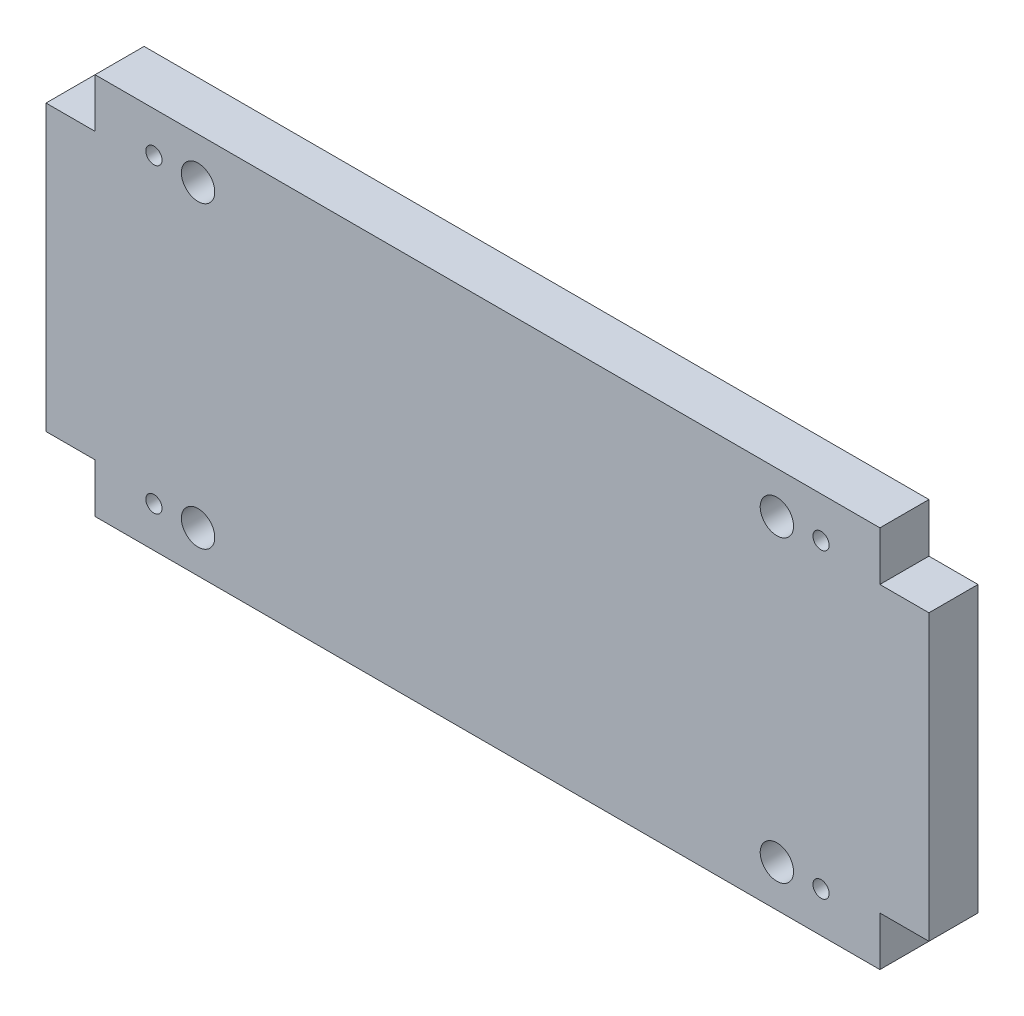
ISO-10303-21;
HEADER;
FILE_DESCRIPTION(('STEP AP214'),'2;1');
FILE_NAME('part.step','',(''),(''),'','','');
FILE_SCHEMA(('AUTOMOTIVE_DESIGN { 1 0 10303 214 1 1 1 1 }'));
ENDSEC;
DATA;
#1=APPLICATION_CONTEXT('core data for automotive mechanical design processes');
#2=APPLICATION_PROTOCOL_DEFINITION('international standard','automotive_design',2000,#1);
#3=PRODUCT_CONTEXT('',#1,'mechanical');
#4=PRODUCT('Part','Part','',(#3));
#5=PRODUCT_RELATED_PRODUCT_CATEGORY('part','',(#4));
#6=PRODUCT_DEFINITION_FORMATION('','',#4);
#7=PRODUCT_DEFINITION_CONTEXT('part definition',#1,'design');
#8=PRODUCT_DEFINITION('design','',#6,#7);
#9=PRODUCT_DEFINITION_SHAPE('','',#8);
#10=(LENGTH_UNIT() NAMED_UNIT(*) SI_UNIT(.MILLI.,.METRE.));
#11=(NAMED_UNIT(*) PLANE_ANGLE_UNIT() SI_UNIT($,.RADIAN.));
#12=(NAMED_UNIT(*) SI_UNIT($,.STERADIAN.) SOLID_ANGLE_UNIT());
#13=UNCERTAINTY_MEASURE_WITH_UNIT(LENGTH_MEASURE(1.E-05),#10,'distance_accuracy_value','');
#14=(GEOMETRIC_REPRESENTATION_CONTEXT(3) GLOBAL_UNCERTAINTY_ASSIGNED_CONTEXT((#13)) GLOBAL_UNIT_ASSIGNED_CONTEXT((#10,
#11,#12)) REPRESENTATION_CONTEXT('',''));
#15=CARTESIAN_POINT('',(0.,0.,0.));
#16=DIRECTION('',(0.,0.,1.));
#17=DIRECTION('',(1.,0.,0.));
#18=AXIS2_PLACEMENT_3D('',#15,#16,#17);
#19=CARTESIAN_POINT('',(80.,-29.,10.));
#20=DIRECTION('',(-1.,0.,0.));
#21=DIRECTION('',(0.,0.,1.));
#22=AXIS2_PLACEMENT_3D('',#19,#20,#21);
#23=PLANE('',#22);
#24=DIRECTION('',(0.,1.,0.));
#25=VECTOR('',#24,1.);
#26=CARTESIAN_POINT('',(80.,-29.,0.));
#27=LINE('',#26,#25);
#28=CARTESIAN_POINT('',(80.,-39.,0.));
#29=VERTEX_POINT('',#28);
#30=CARTESIAN_POINT('',(80.,-29.,0.));
#31=VERTEX_POINT('',#30);
#32=EDGE_CURVE('E168',#29,#31,#27,.T.);
#33=ORIENTED_EDGE('',*,*,#32,.T.);
#34=DIRECTION('',(0.,0.,-1.));
#35=VECTOR('',#34,1.);
#36=CARTESIAN_POINT('',(80.,-29.,10.));
#37=LINE('',#36,#35);
#38=CARTESIAN_POINT('',(80.,-29.,10.));
#39=VERTEX_POINT('',#38);
#40=EDGE_CURVE('E11',#39,#31,#37,.T.);
#41=ORIENTED_EDGE('',*,*,#40,.F.);
#42=DIRECTION('',(0.,1.,0.));
#43=VECTOR('',#42,1.);
#44=CARTESIAN_POINT('',(80.,-29.,10.));
#45=LINE('',#44,#43);
#46=CARTESIAN_POINT('',(80.,-39.,10.));
#47=VERTEX_POINT('',#46);
#48=EDGE_CURVE('E203',#47,#39,#45,.T.);
#49=ORIENTED_EDGE('',*,*,#48,.F.);
#50=DIRECTION('',(0.,0.,-1.));
#51=VECTOR('',#50,1.);
#52=CARTESIAN_POINT('',(80.,-39.,10.));
#53=LINE('',#52,#51);
#54=EDGE_CURVE('E164',#47,#29,#53,.T.);
#55=ORIENTED_EDGE('',*,*,#54,.T.);
#56=EDGE_LOOP('',(#33,#41,#49,#55));
#57=FACE_BOUND('',#56,.T.);
#58=ADVANCED_FACE('F43',(#57),#23,.F.);
#59=CARTESIAN_POINT('',(90.,-29.,10.));
#60=DIRECTION('',(0.,1.,0.));
#61=DIRECTION('',(-1.,0.,0.));
#62=AXIS2_PLACEMENT_3D('',#59,#60,#61);
#63=PLANE('',#62);
#64=DIRECTION('',(1.,0.,0.));
#65=VECTOR('',#64,1.);
#66=CARTESIAN_POINT('',(90.,-29.,0.));
#67=LINE('',#66,#65);
#68=CARTESIAN_POINT('',(90.,-29.,0.));
#69=VERTEX_POINT('',#68);
#70=EDGE_CURVE('E172',#31,#69,#67,.T.);
#71=ORIENTED_EDGE('',*,*,#70,.T.);
#72=DIRECTION('',(0.,0.,-1.));
#73=VECTOR('',#72,1.);
#74=CARTESIAN_POINT('',(90.,-29.,10.));
#75=LINE('',#74,#73);
#76=CARTESIAN_POINT('',(90.,-29.,10.));
#77=VERTEX_POINT('',#76);
#78=EDGE_CURVE('E52',#77,#69,#75,.T.);
#79=ORIENTED_EDGE('',*,*,#78,.F.);
#80=DIRECTION('',(1.,0.,0.));
#81=VECTOR('',#80,1.);
#82=CARTESIAN_POINT('',(90.,-29.,10.));
#83=LINE('',#82,#81);
#84=EDGE_CURVE('E115',#39,#77,#83,.T.);
#85=ORIENTED_EDGE('',*,*,#84,.F.);
#86=ORIENTED_EDGE('',*,*,#40,.T.);
#87=EDGE_LOOP('',(#71,#79,#85,#86));
#88=FACE_BOUND('',#87,.T.);
#89=ADVANCED_FACE('F298',(#88),#63,.F.);
#90=CARTESIAN_POINT('',(90.,29.,10.));
#91=DIRECTION('',(-1.,0.,0.));
#92=DIRECTION('',(0.,0.,1.));
#93=AXIS2_PLACEMENT_3D('',#90,#91,#92);
#94=PLANE('',#93);
#95=DIRECTION('',(0.,1.,0.));
#96=VECTOR('',#95,1.);
#97=CARTESIAN_POINT('',(90.,29.,0.));
#98=LINE('',#97,#96);
#99=CARTESIAN_POINT('',(90.,29.,0.));
#100=VERTEX_POINT('',#99);
#101=EDGE_CURVE('E176',#69,#100,#98,.T.);
#102=ORIENTED_EDGE('',*,*,#101,.T.);
#103=DIRECTION('',(0.,0.,-1.));
#104=VECTOR('',#103,1.);
#105=CARTESIAN_POINT('',(90.,29.,10.));
#106=LINE('',#105,#104);
#107=CARTESIAN_POINT('',(90.,29.,10.));
#108=VERTEX_POINT('',#107);
#109=EDGE_CURVE('E230',#108,#100,#106,.T.);
#110=ORIENTED_EDGE('',*,*,#109,.F.);
#111=DIRECTION('',(0.,1.,0.));
#112=VECTOR('',#111,1.);
#113=CARTESIAN_POINT('',(90.,29.,10.));
#114=LINE('',#113,#112);
#115=EDGE_CURVE('E240',#77,#108,#114,.T.);
#116=ORIENTED_EDGE('',*,*,#115,.F.);
#117=ORIENTED_EDGE('',*,*,#78,.T.);
#118=EDGE_LOOP('',(#102,#110,#116,#117));
#119=FACE_BOUND('',#118,.T.);
#120=ADVANCED_FACE('F238',(#119),#94,.F.);
#121=CARTESIAN_POINT('',(80.,29.,10.));
#122=DIRECTION('',(0.,-1.,0.));
#123=DIRECTION('',(1.,0.,0.));
#124=AXIS2_PLACEMENT_3D('',#121,#122,#123);
#125=PLANE('',#124);
#126=DIRECTION('',(-1.,0.,0.));
#127=VECTOR('',#126,1.);
#128=CARTESIAN_POINT('',(80.,29.,0.));
#129=LINE('',#128,#127);
#130=CARTESIAN_POINT('',(80.,29.,0.));
#131=VERTEX_POINT('',#130);
#132=EDGE_CURVE('E179',#100,#131,#129,.T.);
#133=ORIENTED_EDGE('',*,*,#132,.T.);
#134=DIRECTION('',(0.,0.,-1.));
#135=VECTOR('',#134,1.);
#136=CARTESIAN_POINT('',(80.,29.,10.));
#137=LINE('',#136,#135);
#138=CARTESIAN_POINT('',(80.,29.,10.));
#139=VERTEX_POINT('',#138);
#140=EDGE_CURVE('E226',#139,#131,#137,.T.);
#141=ORIENTED_EDGE('',*,*,#140,.F.);
#142=DIRECTION('',(-1.,0.,0.));
#143=VECTOR('',#142,1.);
#144=CARTESIAN_POINT('',(80.,29.,10.));
#145=LINE('',#144,#143);
#146=EDGE_CURVE('E259',#108,#139,#145,.T.);
#147=ORIENTED_EDGE('',*,*,#146,.F.);
#148=ORIENTED_EDGE('',*,*,#109,.T.);
#149=EDGE_LOOP('',(#133,#141,#147,#148));
#150=FACE_BOUND('',#149,.T.);
#151=ADVANCED_FACE('F249',(#150),#125,.F.);
#152=CARTESIAN_POINT('',(80.,39.,10.));
#153=DIRECTION('',(-1.,0.,0.));
#154=DIRECTION('',(0.,0.,1.));
#155=AXIS2_PLACEMENT_3D('',#152,#153,#154);
#156=PLANE('',#155);
#157=DIRECTION('',(0.,1.,0.));
#158=VECTOR('',#157,1.);
#159=CARTESIAN_POINT('',(80.,39.,0.));
#160=LINE('',#159,#158);
#161=CARTESIAN_POINT('',(80.,39.,0.));
#162=VERTEX_POINT('',#161);
#163=EDGE_CURVE('E182',#131,#162,#160,.T.);
#164=ORIENTED_EDGE('',*,*,#163,.T.);
#165=DIRECTION('',(0.,0.,-1.));
#166=VECTOR('',#165,1.);
#167=CARTESIAN_POINT('',(80.,39.,10.));
#168=LINE('',#167,#166);
#169=CARTESIAN_POINT('',(80.,39.,10.));
#170=VERTEX_POINT('',#169);
#171=EDGE_CURVE('E222',#170,#162,#168,.T.);
#172=ORIENTED_EDGE('',*,*,#171,.F.);
#173=DIRECTION('',(0.,1.,0.));
#174=VECTOR('',#173,1.);
#175=CARTESIAN_POINT('',(80.,39.,10.));
#176=LINE('',#175,#174);
#177=EDGE_CURVE('E255',#139,#170,#176,.T.);
#178=ORIENTED_EDGE('',*,*,#177,.F.);
#179=ORIENTED_EDGE('',*,*,#140,.T.);
#180=EDGE_LOOP('',(#164,#172,#178,#179));
#181=FACE_BOUND('',#180,.T.);
#182=ADVANCED_FACE('F253',(#181),#156,.F.);
#183=CARTESIAN_POINT('',(-80.,39.,10.));
#184=DIRECTION('',(0.,-1.,0.));
#185=DIRECTION('',(0.,0.,-1.));
#186=AXIS2_PLACEMENT_3D('',#183,#184,#185);
#187=PLANE('',#186);
#188=DIRECTION('',(-1.,0.,0.));
#189=VECTOR('',#188,1.);
#190=CARTESIAN_POINT('',(-80.,39.,0.));
#191=LINE('',#190,#189);
#192=CARTESIAN_POINT('',(-80.,39.,0.));
#193=VERTEX_POINT('',#192);
#194=EDGE_CURVE('E185',#162,#193,#191,.T.);
#195=ORIENTED_EDGE('',*,*,#194,.T.);
#196=DIRECTION('',(0.,0.,-1.));
#197=VECTOR('',#196,1.);
#198=CARTESIAN_POINT('',(-80.,39.,10.));
#199=LINE('',#198,#197);
#200=CARTESIAN_POINT('',(-80.,39.,10.));
#201=VERTEX_POINT('',#200);
#202=EDGE_CURVE('E218',#201,#193,#199,.T.);
#203=ORIENTED_EDGE('',*,*,#202,.F.);
#204=DIRECTION('',(-1.,0.,0.));
#205=VECTOR('',#204,1.);
#206=CARTESIAN_POINT('',(-80.,39.,10.));
#207=LINE('',#206,#205);
#208=EDGE_CURVE('E258',#170,#201,#207,.T.);
#209=ORIENTED_EDGE('',*,*,#208,.F.);
#210=ORIENTED_EDGE('',*,*,#171,.T.);
#211=EDGE_LOOP('',(#195,#203,#209,#210));
#212=FACE_BOUND('',#211,.T.);
#213=ADVANCED_FACE('F311',(#212),#187,.F.);
#214=CARTESIAN_POINT('',(-80.,39.,10.));
#215=DIRECTION('',(1.,0.,0.));
#216=DIRECTION('',(0.,0.,-1.));
#217=AXIS2_PLACEMENT_3D('',#214,#215,#216);
#218=PLANE('',#217);
#219=DIRECTION('',(0.,-1.,0.));
#220=VECTOR('',#219,1.);
#221=CARTESIAN_POINT('',(-80.,39.,0.));
#222=LINE('',#221,#220);
#223=CARTESIAN_POINT('',(-80.,29.,0.));
#224=VERTEX_POINT('',#223);
#225=EDGE_CURVE('E188',#193,#224,#222,.T.);
#226=ORIENTED_EDGE('',*,*,#225,.T.);
#227=DIRECTION('',(0.,0.,-1.));
#228=VECTOR('',#227,1.);
#229=CARTESIAN_POINT('',(-80.,29.,10.));
#230=LINE('',#229,#228);
#231=CARTESIAN_POINT('',(-80.,29.,10.));
#232=VERTEX_POINT('',#231);
#233=EDGE_CURVE('E214',#232,#224,#230,.T.);
#234=ORIENTED_EDGE('',*,*,#233,.F.);
#235=DIRECTION('',(0.,-1.,0.));
#236=VECTOR('',#235,1.);
#237=CARTESIAN_POINT('',(-80.,39.,10.));
#238=LINE('',#237,#236);
#239=EDGE_CURVE('E263',#201,#232,#238,.T.);
#240=ORIENTED_EDGE('',*,*,#239,.F.);
#241=ORIENTED_EDGE('',*,*,#202,.T.);
#242=EDGE_LOOP('',(#226,#234,#240,#241));
#243=FACE_BOUND('',#242,.T.);
#244=ADVANCED_FACE('F314',(#243),#218,.F.);
#245=CARTESIAN_POINT('',(-80.,29.,10.));
#246=DIRECTION('',(0.,-1.,0.));
#247=DIRECTION('',(0.,0.,-1.));
#248=AXIS2_PLACEMENT_3D('',#245,#246,#247);
#249=PLANE('',#248);
#250=DIRECTION('',(-1.,0.,0.));
#251=VECTOR('',#250,1.);
#252=CARTESIAN_POINT('',(-80.,29.,0.));
#253=LINE('',#252,#251);
#254=CARTESIAN_POINT('',(-90.,29.,0.));
#255=VERTEX_POINT('',#254);
#256=EDGE_CURVE('E191',#224,#255,#253,.T.);
#257=ORIENTED_EDGE('',*,*,#256,.T.);
#258=DIRECTION('',(0.,0.,-1.));
#259=VECTOR('',#258,1.);
#260=CARTESIAN_POINT('',(-90.,29.,10.));
#261=LINE('',#260,#259);
#262=CARTESIAN_POINT('',(-90.,29.,10.));
#263=VERTEX_POINT('',#262);
#264=EDGE_CURVE('E210',#263,#255,#261,.T.);
#265=ORIENTED_EDGE('',*,*,#264,.F.);
#266=DIRECTION('',(-1.,0.,0.));
#267=VECTOR('',#266,1.);
#268=CARTESIAN_POINT('',(-80.,29.,10.));
#269=LINE('',#268,#267);
#270=EDGE_CURVE('E270',#232,#263,#269,.T.);
#271=ORIENTED_EDGE('',*,*,#270,.F.);
#272=ORIENTED_EDGE('',*,*,#233,.T.);
#273=EDGE_LOOP('',(#257,#265,#271,#272));
#274=FACE_BOUND('',#273,.T.);
#275=ADVANCED_FACE('F278',(#274),#249,.F.);
#276=CARTESIAN_POINT('',(-90.,29.,10.));
#277=DIRECTION('',(1.,0.,0.));
#278=DIRECTION('',(0.,0.,-1.));
#279=AXIS2_PLACEMENT_3D('',#276,#277,#278);
#280=PLANE('',#279);
#281=DIRECTION('',(0.,-1.,0.));
#282=VECTOR('',#281,1.);
#283=CARTESIAN_POINT('',(-90.,29.,0.));
#284=LINE('',#283,#282);
#285=CARTESIAN_POINT('',(-90.,-29.,0.));
#286=VERTEX_POINT('',#285);
#287=EDGE_CURVE('E194',#255,#286,#284,.T.);
#288=ORIENTED_EDGE('',*,*,#287,.T.);
#289=DIRECTION('',(0.,0.,-1.));
#290=VECTOR('',#289,1.);
#291=CARTESIAN_POINT('',(-90.,-29.,10.));
#292=LINE('',#291,#290);
#293=CARTESIAN_POINT('',(-90.,-29.,10.));
#294=VERTEX_POINT('',#293);
#295=EDGE_CURVE('E157',#294,#286,#292,.T.);
#296=ORIENTED_EDGE('',*,*,#295,.F.);
#297=DIRECTION('',(0.,-1.,0.));
#298=VECTOR('',#297,1.);
#299=CARTESIAN_POINT('',(-90.,29.,10.));
#300=LINE('',#299,#298);
#301=EDGE_CURVE('E146',#263,#294,#300,.T.);
#302=ORIENTED_EDGE('',*,*,#301,.F.);
#303=ORIENTED_EDGE('',*,*,#264,.T.);
#304=EDGE_LOOP('',(#288,#296,#302,#303));
#305=FACE_BOUND('',#304,.T.);
#306=ADVANCED_FACE('F282',(#305),#280,.F.);
#307=CARTESIAN_POINT('',(-90.,-29.,10.));
#308=DIRECTION('',(0.,1.,0.));
#309=DIRECTION('',(-1.,0.,0.));
#310=AXIS2_PLACEMENT_3D('',#307,#308,#309);
#311=PLANE('',#310);
#312=DIRECTION('',(1.,0.,0.));
#313=VECTOR('',#312,1.);
#314=CARTESIAN_POINT('',(-90.,-29.,0.));
#315=LINE('',#314,#313);
#316=CARTESIAN_POINT('',(-80.,-29.,0.));
#317=VERTEX_POINT('',#316);
#318=EDGE_CURVE('E155',#286,#317,#315,.T.);
#319=ORIENTED_EDGE('',*,*,#318,.T.);
#320=DIRECTION('',(0.,0.,-1.));
#321=VECTOR('',#320,1.);
#322=CARTESIAN_POINT('',(-80.,-29.,10.));
#323=LINE('',#322,#321);
#324=CARTESIAN_POINT('',(-80.,-29.,10.));
#325=VERTEX_POINT('',#324);
#326=EDGE_CURVE('E152',#325,#317,#323,.T.);
#327=ORIENTED_EDGE('',*,*,#326,.F.);
#328=DIRECTION('',(1.,0.,0.));
#329=VECTOR('',#328,1.);
#330=CARTESIAN_POINT('',(-90.,-29.,10.));
#331=LINE('',#330,#329);
#332=EDGE_CURVE('E140',#294,#325,#331,.T.);
#333=ORIENTED_EDGE('',*,*,#332,.F.);
#334=ORIENTED_EDGE('',*,*,#295,.T.);
#335=EDGE_LOOP('',(#319,#327,#333,#334));
#336=FACE_BOUND('',#335,.T.);
#337=ADVANCED_FACE('F153',(#336),#311,.F.);
#338=CARTESIAN_POINT('',(-80.,-29.,10.));
#339=DIRECTION('',(1.,0.,0.));
#340=DIRECTION('',(0.,0.,-1.));
#341=AXIS2_PLACEMENT_3D('',#338,#339,#340);
#342=PLANE('',#341);
#343=DIRECTION('',(0.,-1.,0.));
#344=VECTOR('',#343,1.);
#345=CARTESIAN_POINT('',(-80.,-29.,0.));
#346=LINE('',#345,#344);
#347=CARTESIAN_POINT('',(-80.,-39.,0.));
#348=VERTEX_POINT('',#347);
#349=EDGE_CURVE('E101',#317,#348,#346,.T.);
#350=ORIENTED_EDGE('',*,*,#349,.T.);
#351=DIRECTION('',(0.,0.,-1.));
#352=VECTOR('',#351,1.);
#353=CARTESIAN_POINT('',(-80.,-39.,10.));
#354=LINE('',#353,#352);
#355=CARTESIAN_POINT('',(-80.,-39.,10.));
#356=VERTEX_POINT('',#355);
#357=EDGE_CURVE('E158',#356,#348,#354,.T.);
#358=ORIENTED_EDGE('',*,*,#357,.F.);
#359=DIRECTION('',(0.,-1.,0.));
#360=VECTOR('',#359,1.);
#361=CARTESIAN_POINT('',(-80.,-29.,10.));
#362=LINE('',#361,#360);
#363=EDGE_CURVE('E144',#325,#356,#362,.T.);
#364=ORIENTED_EDGE('',*,*,#363,.F.);
#365=ORIENTED_EDGE('',*,*,#326,.T.);
#366=EDGE_LOOP('',(#350,#358,#364,#365));
#367=FACE_BOUND('',#366,.T.);
#368=ADVANCED_FACE('F160',(#367),#342,.F.);
#369=CARTESIAN_POINT('',(-80.,-39.,10.));
#370=DIRECTION('',(0.,1.,0.));
#371=DIRECTION('',(0.,0.,1.));
#372=AXIS2_PLACEMENT_3D('',#369,#370,#371);
#373=PLANE('',#372);
#374=DIRECTION('',(1.,0.,0.));
#375=VECTOR('',#374,1.);
#376=CARTESIAN_POINT('',(-80.,-39.,0.));
#377=LINE('',#376,#375);
#378=EDGE_CURVE('E107',#348,#29,#377,.T.);
#379=ORIENTED_EDGE('',*,*,#378,.T.);
#380=ORIENTED_EDGE('',*,*,#54,.F.);
#381=DIRECTION('',(1.,0.,0.));
#382=VECTOR('',#381,1.);
#383=CARTESIAN_POINT('',(-80.,-39.,10.));
#384=LINE('',#383,#382);
#385=EDGE_CURVE('E60',#356,#47,#384,.T.);
#386=ORIENTED_EDGE('',*,*,#385,.F.);
#387=ORIENTED_EDGE('',*,*,#357,.T.);
#388=EDGE_LOOP('',(#379,#380,#386,#387));
#389=FACE_BOUND('',#388,.T.);
#390=ADVANCED_FACE('F286',(#389),#373,.F.);
#391=CARTESIAN_POINT('',(0.,0.,10.));
#392=DIRECTION('',(0.,0.,1.));
#393=DIRECTION('',(1.,0.,0.));
#394=AXIS2_PLACEMENT_3D('',#391,#392,#393);
#395=PLANE('',#394);
#396=CARTESIAN_POINT('',(-59.,30.5,10.));
#397=DIRECTION('',(0.,0.,1.));
#398=DIRECTION('',(1.,0.,0.));
#399=AXIS2_PLACEMENT_3D('',#396,#397,#398);
#400=CIRCLE('',#399,3.39999999999999);
#401=CARTESIAN_POINT('',(-55.6,30.5,10.));
#402=VERTEX_POINT('',#401);
#403=EDGE_CURVE('E496',#402,#402,#400,.T.);
#404=ORIENTED_EDGE('',*,*,#403,.F.);
#405=EDGE_LOOP('',(#404));
#406=FACE_BOUND('',#405,.T.);
#407=CARTESIAN_POINT('',(-59.,-30.5,10.));
#408=DIRECTION('',(0.,0.,1.));
#409=DIRECTION('',(1.,0.,0.));
#410=AXIS2_PLACEMENT_3D('',#407,#408,#409);
#411=CIRCLE('',#410,3.39999999999999);
#412=CARTESIAN_POINT('',(-55.6,-30.5,10.));
#413=VERTEX_POINT('',#412);
#414=EDGE_CURVE('E500',#413,#413,#411,.T.);
#415=ORIENTED_EDGE('',*,*,#414,.F.);
#416=EDGE_LOOP('',(#415));
#417=FACE_BOUND('',#416,.T.);
#418=CARTESIAN_POINT('',(59.,-30.5,10.));
#419=DIRECTION('',(0.,0.,1.));
#420=DIRECTION('',(1.,0.,0.));
#421=AXIS2_PLACEMENT_3D('',#418,#419,#420);
#422=CIRCLE('',#421,3.39999999999999);
#423=CARTESIAN_POINT('',(62.4,-30.5,10.));
#424=VERTEX_POINT('',#423);
#425=EDGE_CURVE('E510',#424,#424,#422,.T.);
#426=ORIENTED_EDGE('',*,*,#425,.F.);
#427=EDGE_LOOP('',(#426));
#428=FACE_BOUND('',#427,.T.);
#429=CARTESIAN_POINT('',(59.,30.5,10.));
#430=DIRECTION('',(0.,0.,1.));
#431=DIRECTION('',(1.,0.,0.));
#432=AXIS2_PLACEMENT_3D('',#429,#430,#431);
#433=CIRCLE('',#432,3.39999999999999);
#434=CARTESIAN_POINT('',(62.4,30.5,10.));
#435=VERTEX_POINT('',#434);
#436=EDGE_CURVE('E518',#435,#435,#433,.T.);
#437=ORIENTED_EDGE('',*,*,#436,.F.);
#438=EDGE_LOOP('',(#437));
#439=FACE_BOUND('',#438,.T.);
#440=CARTESIAN_POINT('',(-68.,30.75,10.));
#441=DIRECTION('',(0.,0.,1.));
#442=DIRECTION('',(1.,0.,0.));
#443=AXIS2_PLACEMENT_3D('',#440,#441,#442);
#444=CIRCLE('',#443,1.64999999999998);
#445=CARTESIAN_POINT('',(-66.35,30.75,10.));
#446=VERTEX_POINT('',#445);
#447=EDGE_CURVE('E526',#446,#446,#444,.T.);
#448=ORIENTED_EDGE('',*,*,#447,.F.);
#449=EDGE_LOOP('',(#448));
#450=FACE_BOUND('',#449,.T.);
#451=CARTESIAN_POINT('',(-68.,-30.75,10.));
#452=DIRECTION('',(0.,0.,1.));
#453=DIRECTION('',(1.,0.,0.));
#454=AXIS2_PLACEMENT_3D('',#451,#452,#453);
#455=CIRCLE('',#454,1.64999999999998);
#456=CARTESIAN_POINT('',(-66.35,-30.75,10.));
#457=VERTEX_POINT('',#456);
#458=EDGE_CURVE('E534',#457,#457,#455,.T.);
#459=ORIENTED_EDGE('',*,*,#458,.F.);
#460=EDGE_LOOP('',(#459));
#461=FACE_BOUND('',#460,.T.);
#462=CARTESIAN_POINT('',(68.,-30.75,10.));
#463=DIRECTION('',(0.,0.,1.));
#464=DIRECTION('',(1.,0.,0.));
#465=AXIS2_PLACEMENT_3D('',#462,#463,#464);
#466=CIRCLE('',#465,1.64999999999998);
#467=CARTESIAN_POINT('',(69.65,-30.75,10.));
#468=VERTEX_POINT('',#467);
#469=EDGE_CURVE('E542',#468,#468,#466,.T.);
#470=ORIENTED_EDGE('',*,*,#469,.F.);
#471=EDGE_LOOP('',(#470));
#472=FACE_BOUND('',#471,.T.);
#473=CARTESIAN_POINT('',(68.,30.75,10.));
#474=DIRECTION('',(0.,0.,1.));
#475=DIRECTION('',(1.,0.,0.));
#476=AXIS2_PLACEMENT_3D('',#473,#474,#475);
#477=CIRCLE('',#476,1.64999999999998);
#478=CARTESIAN_POINT('',(69.65,30.75,10.));
#479=VERTEX_POINT('',#478);
#480=EDGE_CURVE('E550',#479,#479,#477,.T.);
#481=ORIENTED_EDGE('',*,*,#480,.F.);
#482=EDGE_LOOP('',(#481));
#483=FACE_BOUND('',#482,.T.);
#484=ORIENTED_EDGE('',*,*,#48,.T.);
#485=ORIENTED_EDGE('',*,*,#84,.T.);
#486=ORIENTED_EDGE('',*,*,#115,.T.);
#487=ORIENTED_EDGE('',*,*,#146,.T.);
#488=ORIENTED_EDGE('',*,*,#177,.T.);
#489=ORIENTED_EDGE('',*,*,#208,.T.);
#490=ORIENTED_EDGE('',*,*,#239,.T.);
#491=ORIENTED_EDGE('',*,*,#270,.T.);
#492=ORIENTED_EDGE('',*,*,#301,.T.);
#493=ORIENTED_EDGE('',*,*,#332,.T.);
#494=ORIENTED_EDGE('',*,*,#363,.T.);
#495=ORIENTED_EDGE('',*,*,#385,.T.);
#496=EDGE_LOOP('',(#484,#485,#486,#487,#488,#489,#490,#491,#492,#493,#494,#495));
#497=FACE_BOUND('',#496,.T.);
#498=ADVANCED_FACE('F142',(#406,#417,#428,#439,#450,#461,#472,#483,#497),#395,.T.);
#499=CARTESIAN_POINT('',(0.,0.,0.));
#500=DIRECTION('',(0.,0.,1.));
#501=DIRECTION('',(1.,0.,0.));
#502=AXIS2_PLACEMENT_3D('',#499,#500,#501);
#503=PLANE('',#502);
#504=CARTESIAN_POINT('',(-59.,30.5,0.));
#505=DIRECTION('',(0.,0.,1.));
#506=DIRECTION('',(1.,0.,0.));
#507=AXIS2_PLACEMENT_3D('',#504,#505,#506);
#508=CIRCLE('',#507,3.39999999999999);
#509=CARTESIAN_POINT('',(-55.6,30.5,0.));
#510=VERTEX_POINT('',#509);
#511=EDGE_CURVE('E493',#510,#510,#508,.T.);
#512=ORIENTED_EDGE('',*,*,#511,.T.);
#513=EDGE_LOOP('',(#512));
#514=FACE_BOUND('',#513,.T.);
#515=CARTESIAN_POINT('',(-59.,-30.5,0.));
#516=DIRECTION('',(0.,0.,1.));
#517=DIRECTION('',(1.,0.,0.));
#518=AXIS2_PLACEMENT_3D('',#515,#516,#517);
#519=CIRCLE('',#518,3.39999999999999);
#520=CARTESIAN_POINT('',(-55.6,-30.5,0.));
#521=VERTEX_POINT('',#520);
#522=EDGE_CURVE('E506',#521,#521,#519,.T.);
#523=ORIENTED_EDGE('',*,*,#522,.T.);
#524=EDGE_LOOP('',(#523));
#525=FACE_BOUND('',#524,.T.);
#526=CARTESIAN_POINT('',(59.,-30.5,0.));
#527=DIRECTION('',(0.,0.,1.));
#528=DIRECTION('',(1.,0.,0.));
#529=AXIS2_PLACEMENT_3D('',#526,#527,#528);
#530=CIRCLE('',#529,3.39999999999999);
#531=CARTESIAN_POINT('',(62.4,-30.5,0.));
#532=VERTEX_POINT('',#531);
#533=EDGE_CURVE('E514',#532,#532,#530,.T.);
#534=ORIENTED_EDGE('',*,*,#533,.T.);
#535=EDGE_LOOP('',(#534));
#536=FACE_BOUND('',#535,.T.);
#537=CARTESIAN_POINT('',(59.,30.5,0.));
#538=DIRECTION('',(0.,0.,1.));
#539=DIRECTION('',(1.,0.,0.));
#540=AXIS2_PLACEMENT_3D('',#537,#538,#539);
#541=CIRCLE('',#540,3.39999999999999);
#542=CARTESIAN_POINT('',(62.4,30.5,0.));
#543=VERTEX_POINT('',#542);
#544=EDGE_CURVE('E522',#543,#543,#541,.T.);
#545=ORIENTED_EDGE('',*,*,#544,.T.);
#546=EDGE_LOOP('',(#545));
#547=FACE_BOUND('',#546,.T.);
#548=CARTESIAN_POINT('',(-68.,30.75,0.));
#549=DIRECTION('',(0.,0.,1.));
#550=DIRECTION('',(1.,0.,0.));
#551=AXIS2_PLACEMENT_3D('',#548,#549,#550);
#552=CIRCLE('',#551,1.65);
#553=CARTESIAN_POINT('',(-66.35,30.75,0.));
#554=VERTEX_POINT('',#553);
#555=EDGE_CURVE('E530',#554,#554,#552,.T.);
#556=ORIENTED_EDGE('',*,*,#555,.T.);
#557=EDGE_LOOP('',(#556));
#558=FACE_BOUND('',#557,.T.);
#559=CARTESIAN_POINT('',(-68.,-30.75,0.));
#560=DIRECTION('',(0.,0.,1.));
#561=DIRECTION('',(1.,0.,0.));
#562=AXIS2_PLACEMENT_3D('',#559,#560,#561);
#563=CIRCLE('',#562,1.65);
#564=CARTESIAN_POINT('',(-66.35,-30.75,0.));
#565=VERTEX_POINT('',#564);
#566=EDGE_CURVE('E538',#565,#565,#563,.T.);
#567=ORIENTED_EDGE('',*,*,#566,.T.);
#568=EDGE_LOOP('',(#567));
#569=FACE_BOUND('',#568,.T.);
#570=CARTESIAN_POINT('',(68.,-30.75,0.));
#571=DIRECTION('',(0.,0.,1.));
#572=DIRECTION('',(1.,0.,0.));
#573=AXIS2_PLACEMENT_3D('',#570,#571,#572);
#574=CIRCLE('',#573,1.65);
#575=CARTESIAN_POINT('',(69.65,-30.75,0.));
#576=VERTEX_POINT('',#575);
#577=EDGE_CURVE('E546',#576,#576,#574,.T.);
#578=ORIENTED_EDGE('',*,*,#577,.T.);
#579=EDGE_LOOP('',(#578));
#580=FACE_BOUND('',#579,.T.);
#581=CARTESIAN_POINT('',(68.,30.75,0.));
#582=DIRECTION('',(0.,0.,1.));
#583=DIRECTION('',(1.,0.,0.));
#584=AXIS2_PLACEMENT_3D('',#581,#582,#583);
#585=CIRCLE('',#584,1.65);
#586=CARTESIAN_POINT('',(69.65,30.75,0.));
#587=VERTEX_POINT('',#586);
#588=EDGE_CURVE('E173',#587,#587,#585,.T.);
#589=ORIENTED_EDGE('',*,*,#588,.T.);
#590=EDGE_LOOP('',(#589));
#591=FACE_BOUND('',#590,.T.);
#592=ORIENTED_EDGE('',*,*,#32,.F.);
#593=ORIENTED_EDGE('',*,*,#378,.F.);
#594=ORIENTED_EDGE('',*,*,#349,.F.);
#595=ORIENTED_EDGE('',*,*,#318,.F.);
#596=ORIENTED_EDGE('',*,*,#287,.F.);
#597=ORIENTED_EDGE('',*,*,#256,.F.);
#598=ORIENTED_EDGE('',*,*,#225,.F.);
#599=ORIENTED_EDGE('',*,*,#194,.F.);
#600=ORIENTED_EDGE('',*,*,#163,.F.);
#601=ORIENTED_EDGE('',*,*,#132,.F.);
#602=ORIENTED_EDGE('',*,*,#101,.F.);
#603=ORIENTED_EDGE('',*,*,#70,.F.);
#604=EDGE_LOOP('',(#592,#593,#594,#595,#596,#597,#598,#599,#600,#601,#602,#603));
#605=FACE_BOUND('',#604,.T.);
#606=ADVANCED_FACE('F244',(#514,#525,#536,#547,#558,#569,#580,#591,#605),#503,.F.);
#607=CARTESIAN_POINT('',(68.,30.75,10.));
#608=DIRECTION('',(0.,0.,1.));
#609=DIRECTION('',(1.,0.,0.));
#610=AXIS2_PLACEMENT_3D('',#607,#608,#609);
#611=CYLINDRICAL_SURFACE('',#610,1.64999999999999);
#612=ORIENTED_EDGE('',*,*,#588,.F.);
#613=EDGE_LOOP('',(#612));
#614=FACE_BOUND('',#613,.T.);
#615=ORIENTED_EDGE('',*,*,#480,.T.);
#616=EDGE_LOOP('',(#615));
#617=FACE_BOUND('',#616,.T.);
#618=ADVANCED_FACE('F342',(#614,#617),#611,.F.);
#619=CARTESIAN_POINT('',(68.,-30.75,10.));
#620=DIRECTION('',(0.,0.,1.));
#621=DIRECTION('',(1.,0.,0.));
#622=AXIS2_PLACEMENT_3D('',#619,#620,#621);
#623=CYLINDRICAL_SURFACE('',#622,1.64999999999999);
#624=ORIENTED_EDGE('',*,*,#577,.F.);
#625=EDGE_LOOP('',(#624));
#626=FACE_BOUND('',#625,.T.);
#627=ORIENTED_EDGE('',*,*,#469,.T.);
#628=EDGE_LOOP('',(#627));
#629=FACE_BOUND('',#628,.T.);
#630=ADVANCED_FACE('F348',(#626,#629),#623,.F.);
#631=CARTESIAN_POINT('',(-68.,-30.75,10.));
#632=DIRECTION('',(0.,0.,1.));
#633=DIRECTION('',(1.,0.,0.));
#634=AXIS2_PLACEMENT_3D('',#631,#632,#633);
#635=CYLINDRICAL_SURFACE('',#634,1.64999999999999);
#636=ORIENTED_EDGE('',*,*,#566,.F.);
#637=EDGE_LOOP('',(#636));
#638=FACE_BOUND('',#637,.T.);
#639=ORIENTED_EDGE('',*,*,#458,.T.);
#640=EDGE_LOOP('',(#639));
#641=FACE_BOUND('',#640,.T.);
#642=ADVANCED_FACE('F361',(#638,#641),#635,.F.);
#643=CARTESIAN_POINT('',(-68.,30.75,10.));
#644=DIRECTION('',(0.,0.,1.));
#645=DIRECTION('',(1.,0.,0.));
#646=AXIS2_PLACEMENT_3D('',#643,#644,#645);
#647=CYLINDRICAL_SURFACE('',#646,1.64999999999999);
#648=ORIENTED_EDGE('',*,*,#555,.F.);
#649=EDGE_LOOP('',(#648));
#650=FACE_BOUND('',#649,.T.);
#651=ORIENTED_EDGE('',*,*,#447,.T.);
#652=EDGE_LOOP('',(#651));
#653=FACE_BOUND('',#652,.T.);
#654=ADVANCED_FACE('F373',(#650,#653),#647,.F.);
#655=CARTESIAN_POINT('',(59.,30.5,10.));
#656=DIRECTION('',(0.,0.,1.));
#657=DIRECTION('',(1.,0.,0.));
#658=AXIS2_PLACEMENT_3D('',#655,#656,#657);
#659=CYLINDRICAL_SURFACE('',#658,3.39999999999999);
#660=ORIENTED_EDGE('',*,*,#544,.F.);
#661=EDGE_LOOP('',(#660));
#662=FACE_BOUND('',#661,.T.);
#663=ORIENTED_EDGE('',*,*,#436,.T.);
#664=EDGE_LOOP('',(#663));
#665=FACE_BOUND('',#664,.T.);
#666=ADVANCED_FACE('F385',(#662,#665),#659,.F.);
#667=CARTESIAN_POINT('',(59.,-30.5,10.));
#668=DIRECTION('',(0.,0.,1.));
#669=DIRECTION('',(1.,0.,0.));
#670=AXIS2_PLACEMENT_3D('',#667,#668,#669);
#671=CYLINDRICAL_SURFACE('',#670,3.39999999999999);
#672=ORIENTED_EDGE('',*,*,#533,.F.);
#673=EDGE_LOOP('',(#672));
#674=FACE_BOUND('',#673,.T.);
#675=ORIENTED_EDGE('',*,*,#425,.T.);
#676=EDGE_LOOP('',(#675));
#677=FACE_BOUND('',#676,.T.);
#678=ADVANCED_FACE('F415',(#674,#677),#671,.F.);
#679=CARTESIAN_POINT('',(-59.,-30.5,10.));
#680=DIRECTION('',(0.,0.,1.));
#681=DIRECTION('',(1.,0.,0.));
#682=AXIS2_PLACEMENT_3D('',#679,#680,#681);
#683=CYLINDRICAL_SURFACE('',#682,3.39999999999999);
#684=ORIENTED_EDGE('',*,*,#522,.F.);
#685=EDGE_LOOP('',(#684));
#686=FACE_BOUND('',#685,.T.);
#687=ORIENTED_EDGE('',*,*,#414,.T.);
#688=EDGE_LOOP('',(#687));
#689=FACE_BOUND('',#688,.T.);
#690=ADVANCED_FACE('F426',(#686,#689),#683,.F.);
#691=CARTESIAN_POINT('',(-59.,30.5,10.));
#692=DIRECTION('',(0.,0.,1.));
#693=DIRECTION('',(1.,0.,0.));
#694=AXIS2_PLACEMENT_3D('',#691,#692,#693);
#695=CYLINDRICAL_SURFACE('',#694,3.39999999999999);
#696=ORIENTED_EDGE('',*,*,#511,.F.);
#697=EDGE_LOOP('',(#696));
#698=FACE_BOUND('',#697,.T.);
#699=ORIENTED_EDGE('',*,*,#403,.T.);
#700=EDGE_LOOP('',(#699));
#701=FACE_BOUND('',#700,.T.);
#702=ADVANCED_FACE('F437',(#698,#701),#695,.F.);
#703=CLOSED_SHELL('',(#58,#89,#120,#151,#182,#213,#244,#275,#306,#337,#368,#390,#498,#606,#618,
#630,#642,#654,#666,#678,#690,#702));
#704=MANIFOLD_SOLID_BREP('B2',#703);
#705=ADVANCED_BREP_SHAPE_REPRESENTATION('',(#18,#704),#14);
#706=SHAPE_DEFINITION_REPRESENTATION(#9,#705);
ENDSEC;
END-ISO-10303-21;
